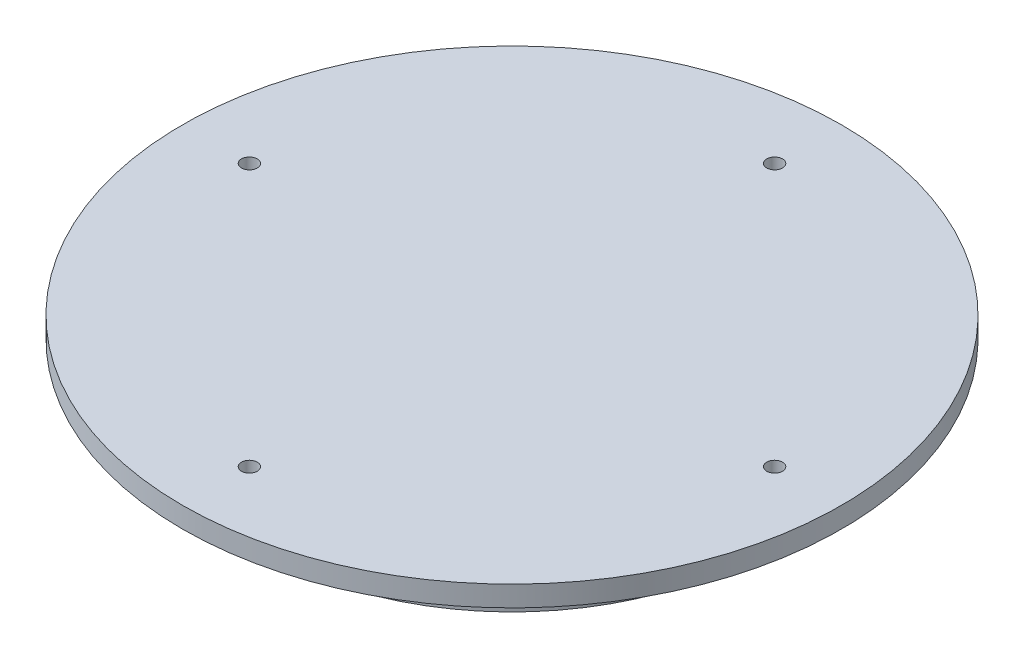
ISO-10303-21;
HEADER;
FILE_DESCRIPTION(('STEP AP214'),'2;1');
FILE_NAME('part.step','',(''),(''),'','','');
FILE_SCHEMA(('AUTOMOTIVE_DESIGN { 1 0 10303 214 1 1 1 1 }'));
ENDSEC;
DATA;
#1=APPLICATION_CONTEXT('core data for automotive mechanical design processes');
#2=APPLICATION_PROTOCOL_DEFINITION('international standard','automotive_design',2000,#1);
#3=PRODUCT_CONTEXT('',#1,'mechanical');
#4=PRODUCT('Part','Part','',(#3));
#5=PRODUCT_RELATED_PRODUCT_CATEGORY('part','',(#4));
#6=PRODUCT_DEFINITION_FORMATION('','',#4);
#7=PRODUCT_DEFINITION_CONTEXT('part definition',#1,'design');
#8=PRODUCT_DEFINITION('design','',#6,#7);
#9=PRODUCT_DEFINITION_SHAPE('','',#8);
#10=(LENGTH_UNIT() NAMED_UNIT(*) SI_UNIT(.MILLI.,.METRE.));
#11=(NAMED_UNIT(*) PLANE_ANGLE_UNIT() SI_UNIT($,.RADIAN.));
#12=(NAMED_UNIT(*) SI_UNIT($,.STERADIAN.) SOLID_ANGLE_UNIT());
#13=UNCERTAINTY_MEASURE_WITH_UNIT(LENGTH_MEASURE(1.E-05),#10,'distance_accuracy_value','');
#14=(GEOMETRIC_REPRESENTATION_CONTEXT(3) GLOBAL_UNCERTAINTY_ASSIGNED_CONTEXT((#13)) GLOBAL_UNIT_ASSIGNED_CONTEXT((#10,
#11,#12)) REPRESENTATION_CONTEXT('',''));
#15=CARTESIAN_POINT('',(0.,0.,0.));
#16=DIRECTION('',(0.,0.,1.));
#17=DIRECTION('',(1.,0.,0.));
#18=AXIS2_PLACEMENT_3D('',#15,#16,#17);
#19=CARTESIAN_POINT('',(0.,0.,0.));
#20=DIRECTION('',(0.,1.,0.));
#21=DIRECTION('',(0.,0.,1.));
#22=AXIS2_PLACEMENT_3D('',#19,#20,#21);
#23=PLANE('',#22);
#24=CARTESIAN_POINT('',(0.,0.,-40.48125));
#25=DIRECTION('',(0.,1.,0.));
#26=DIRECTION('',(0.,0.,1.));
#27=AXIS2_PLACEMENT_3D('',#24,#25,#26);
#28=CIRCLE('',#27,1.2192);
#29=CARTESIAN_POINT('',(0.,0.,-39.26205));
#30=VERTEX_POINT('',#29);
#31=EDGE_CURVE('E37',#30,#30,#28,.T.);
#32=ORIENTED_EDGE('',*,*,#31,.T.);
#33=EDGE_LOOP('',(#32));
#34=FACE_BOUND('',#33,.T.);
#35=CARTESIAN_POINT('',(40.48125,0.,0.));
#36=DIRECTION('',(0.,1.,0.));
#37=DIRECTION('',(0.,0.,1.));
#38=AXIS2_PLACEMENT_3D('',#35,#36,#37);
#39=CIRCLE('',#38,1.2192);
#40=CARTESIAN_POINT('',(40.48125,0.,1.21919999999999));
#41=VERTEX_POINT('',#40);
#42=EDGE_CURVE('E68',#41,#41,#39,.T.);
#43=ORIENTED_EDGE('',*,*,#42,.T.);
#44=EDGE_LOOP('',(#43));
#45=FACE_BOUND('',#44,.T.);
#46=CARTESIAN_POINT('',(-40.48125,0.,0.));
#47=DIRECTION('',(0.,1.,0.));
#48=DIRECTION('',(0.,0.,1.));
#49=AXIS2_PLACEMENT_3D('',#46,#47,#48);
#50=CIRCLE('',#49,1.2192);
#51=CARTESIAN_POINT('',(-40.48125,0.,1.2192));
#52=VERTEX_POINT('',#51);
#53=EDGE_CURVE('E58',#52,#52,#50,.T.);
#54=ORIENTED_EDGE('',*,*,#53,.T.);
#55=EDGE_LOOP('',(#54));
#56=FACE_BOUND('',#55,.T.);
#57=CARTESIAN_POINT('',(0.,0.,40.48125));
#58=DIRECTION('',(0.,1.,0.));
#59=DIRECTION('',(0.,0.,1.));
#60=AXIS2_PLACEMENT_3D('',#57,#58,#59);
#61=CIRCLE('',#60,1.2192);
#62=CARTESIAN_POINT('',(0.,0.,41.70045));
#63=VERTEX_POINT('',#62);
#64=EDGE_CURVE('E49',#63,#63,#61,.T.);
#65=ORIENTED_EDGE('',*,*,#64,.T.);
#66=EDGE_LOOP('',(#65));
#67=FACE_BOUND('',#66,.T.);
#68=CARTESIAN_POINT('',(0.,0.,0.));
#69=DIRECTION('',(0.,1.,0.));
#70=DIRECTION('',(0.,0.,1.));
#71=AXIS2_PLACEMENT_3D('',#68,#69,#70);
#72=CIRCLE('',#71,50.8);
#73=CARTESIAN_POINT('',(0.,0.,50.8));
#74=VERTEX_POINT('',#73);
#75=EDGE_CURVE('E46',#74,#74,#72,.T.);
#76=ORIENTED_EDGE('',*,*,#75,.F.);
#77=EDGE_LOOP('',(#76));
#78=FACE_BOUND('',#77,.T.);
#79=CARTESIAN_POINT('',(0.,0.,0.));
#80=DIRECTION('',(0.,1.,0.));
#81=DIRECTION('',(0.,0.,1.));
#82=AXIS2_PLACEMENT_3D('',#79,#80,#81);
#83=CIRCLE('',#82,38.1);
#84=CARTESIAN_POINT('',(0.,0.,38.1));
#85=VERTEX_POINT('',#84);
#86=EDGE_CURVE('E10',#85,#85,#83,.F.);
#87=ORIENTED_EDGE('',*,*,#86,.F.);
#88=EDGE_LOOP('',(#87));
#89=FACE_BOUND('',#88,.T.);
#90=ADVANCED_FACE('F33',(#34,#45,#56,#67,#78,#89),#23,.F.);
#91=CARTESIAN_POINT('',(0.,3.175,0.));
#92=DIRECTION('',(0.,-1.,0.));
#93=DIRECTION('',(0.,0.,-1.));
#94=AXIS2_PLACEMENT_3D('',#91,#92,#93);
#95=CYLINDRICAL_SURFACE('',#94,50.8);
#96=CARTESIAN_POINT('',(0.,3.175,0.));
#97=DIRECTION('',(0.,1.,0.));
#98=DIRECTION('',(0.,0.,1.));
#99=AXIS2_PLACEMENT_3D('',#96,#97,#98);
#100=CIRCLE('',#99,50.8);
#101=CARTESIAN_POINT('',(0.,3.175,50.8));
#102=VERTEX_POINT('',#101);
#103=EDGE_CURVE('E41',#102,#102,#100,.T.);
#104=ORIENTED_EDGE('',*,*,#103,.F.);
#105=EDGE_LOOP('',(#104));
#106=FACE_BOUND('',#105,.T.);
#107=ORIENTED_EDGE('',*,*,#75,.T.);
#108=EDGE_LOOP('',(#107));
#109=FACE_BOUND('',#108,.T.);
#110=ADVANCED_FACE('F35',(#106,#109),#95,.T.);
#111=CARTESIAN_POINT('',(0.,3.175,0.));
#112=DIRECTION('',(0.,1.,0.));
#113=DIRECTION('',(0.,0.,1.));
#114=AXIS2_PLACEMENT_3D('',#111,#112,#113);
#115=PLANE('',#114);
#116=CARTESIAN_POINT('',(0.,3.175,-40.48125));
#117=DIRECTION('',(0.,1.,0.));
#118=DIRECTION('',(0.,0.,1.));
#119=AXIS2_PLACEMENT_3D('',#116,#117,#118);
#120=CIRCLE('',#119,1.2192);
#121=CARTESIAN_POINT('',(0.,3.175,-39.26205));
#122=VERTEX_POINT('',#121);
#123=EDGE_CURVE('E74',#122,#122,#120,.T.);
#124=ORIENTED_EDGE('',*,*,#123,.F.);
#125=EDGE_LOOP('',(#124));
#126=FACE_BOUND('',#125,.T.);
#127=CARTESIAN_POINT('',(40.48125,3.175,0.));
#128=DIRECTION('',(0.,1.,0.));
#129=DIRECTION('',(0.,0.,1.));
#130=AXIS2_PLACEMENT_3D('',#127,#128,#129);
#131=CIRCLE('',#130,1.2192);
#132=CARTESIAN_POINT('',(40.48125,3.175,1.21919999999999));
#133=VERTEX_POINT('',#132);
#134=EDGE_CURVE('E71',#133,#133,#131,.T.);
#135=ORIENTED_EDGE('',*,*,#134,.F.);
#136=EDGE_LOOP('',(#135));
#137=FACE_BOUND('',#136,.T.);
#138=CARTESIAN_POINT('',(-40.48125,3.175,0.));
#139=DIRECTION('',(0.,1.,0.));
#140=DIRECTION('',(0.,0.,1.));
#141=AXIS2_PLACEMENT_3D('',#138,#139,#140);
#142=CIRCLE('',#141,1.2192);
#143=CARTESIAN_POINT('',(-40.48125,3.175,1.2192));
#144=VERTEX_POINT('',#143);
#145=EDGE_CURVE('E63',#144,#144,#142,.T.);
#146=ORIENTED_EDGE('',*,*,#145,.F.);
#147=EDGE_LOOP('',(#146));
#148=FACE_BOUND('',#147,.T.);
#149=CARTESIAN_POINT('',(0.,3.175,40.48125));
#150=DIRECTION('',(0.,1.,0.));
#151=DIRECTION('',(0.,0.,1.));
#152=AXIS2_PLACEMENT_3D('',#149,#150,#151);
#153=CIRCLE('',#152,1.2192);
#154=CARTESIAN_POINT('',(0.,3.175,41.70045));
#155=VERTEX_POINT('',#154);
#156=EDGE_CURVE('E52',#155,#155,#153,.T.);
#157=ORIENTED_EDGE('',*,*,#156,.F.);
#158=EDGE_LOOP('',(#157));
#159=FACE_BOUND('',#158,.T.);
#160=ORIENTED_EDGE('',*,*,#103,.T.);
#161=EDGE_LOOP('',(#160));
#162=FACE_BOUND('',#161,.T.);
#163=ADVANCED_FACE('F97',(#126,#137,#148,#159,#162),#115,.T.);
#164=CARTESIAN_POINT('',(0.,-9.525,0.));
#165=DIRECTION('',(0.,1.,0.));
#166=DIRECTION('',(0.,0.,1.));
#167=AXIS2_PLACEMENT_3D('',#164,#165,#166);
#168=CYLINDRICAL_SURFACE('',#167,38.1);
#169=CARTESIAN_POINT('',(0.,-9.525,0.));
#170=DIRECTION('',(0.,-1.,0.));
#171=DIRECTION('',(0.,0.,-1.));
#172=AXIS2_PLACEMENT_3D('',#169,#170,#171);
#173=CIRCLE('',#172,38.1);
#174=CARTESIAN_POINT('',(0.,-9.525,-38.1));
#175=VERTEX_POINT('',#174);
#176=EDGE_CURVE('E51',#175,#175,#173,.T.);
#177=ORIENTED_EDGE('',*,*,#176,.F.);
#178=EDGE_LOOP('',(#177));
#179=FACE_BOUND('',#178,.T.);
#180=ORIENTED_EDGE('',*,*,#86,.T.);
#181=EDGE_LOOP('',(#180));
#182=FACE_BOUND('',#181,.T.);
#183=ADVANCED_FACE('F102',(#179,#182),#168,.T.);
#184=CARTESIAN_POINT('',(0.,-9.525,0.));
#185=DIRECTION('',(0.,-1.,0.));
#186=DIRECTION('',(0.,0.,-1.));
#187=AXIS2_PLACEMENT_3D('',#184,#185,#186);
#188=PLANE('',#187);
#189=ORIENTED_EDGE('',*,*,#176,.T.);
#190=EDGE_LOOP('',(#189));
#191=FACE_BOUND('',#190,.T.);
#192=ADVANCED_FACE('F106',(#191),#188,.T.);
#193=CARTESIAN_POINT('',(0.,3.175,40.48125));
#194=DIRECTION('',(0.,1.,0.));
#195=DIRECTION('',(0.,0.,1.));
#196=AXIS2_PLACEMENT_3D('',#193,#194,#195);
#197=CYLINDRICAL_SURFACE('',#196,1.2192);
#198=ORIENTED_EDGE('',*,*,#156,.T.);
#199=EDGE_LOOP('',(#198));
#200=FACE_BOUND('',#199,.T.);
#201=ORIENTED_EDGE('',*,*,#64,.F.);
#202=EDGE_LOOP('',(#201));
#203=FACE_BOUND('',#202,.T.);
#204=ADVANCED_FACE('F110',(#200,#203),#197,.F.);
#205=CARTESIAN_POINT('',(-40.48125,3.175,0.));
#206=DIRECTION('',(0.,1.,0.));
#207=DIRECTION('',(0.,0.,1.));
#208=AXIS2_PLACEMENT_3D('',#205,#206,#207);
#209=CYLINDRICAL_SURFACE('',#208,1.2192);
#210=ORIENTED_EDGE('',*,*,#145,.T.);
#211=EDGE_LOOP('',(#210));
#212=FACE_BOUND('',#211,.T.);
#213=ORIENTED_EDGE('',*,*,#53,.F.);
#214=EDGE_LOOP('',(#213));
#215=FACE_BOUND('',#214,.T.);
#216=ADVANCED_FACE('F90',(#212,#215),#209,.F.);
#217=CARTESIAN_POINT('',(40.48125,3.175,0.));
#218=DIRECTION('',(0.,1.,0.));
#219=DIRECTION('',(0.,0.,1.));
#220=AXIS2_PLACEMENT_3D('',#217,#218,#219);
#221=CYLINDRICAL_SURFACE('',#220,1.2192);
#222=ORIENTED_EDGE('',*,*,#134,.T.);
#223=EDGE_LOOP('',(#222));
#224=FACE_BOUND('',#223,.T.);
#225=ORIENTED_EDGE('',*,*,#42,.F.);
#226=EDGE_LOOP('',(#225));
#227=FACE_BOUND('',#226,.T.);
#228=ADVANCED_FACE('F85',(#224,#227),#221,.F.);
#229=CARTESIAN_POINT('',(0.,3.175,-40.48125));
#230=DIRECTION('',(0.,1.,0.));
#231=DIRECTION('',(0.,0.,1.));
#232=AXIS2_PLACEMENT_3D('',#229,#230,#231);
#233=CYLINDRICAL_SURFACE('',#232,1.2192);
#234=ORIENTED_EDGE('',*,*,#123,.T.);
#235=EDGE_LOOP('',(#234));
#236=FACE_BOUND('',#235,.T.);
#237=ORIENTED_EDGE('',*,*,#31,.F.);
#238=EDGE_LOOP('',(#237));
#239=FACE_BOUND('',#238,.T.);
#240=ADVANCED_FACE('F83',(#236,#239),#233,.F.);
#241=CLOSED_SHELL('',(#90,#110,#163,#183,#192,#204,#216,#228,#240));
#242=MANIFOLD_SOLID_BREP('B2',#241);
#243=ADVANCED_BREP_SHAPE_REPRESENTATION('',(#18,#242),#14);
#244=SHAPE_DEFINITION_REPRESENTATION(#9,#243);
ENDSEC;
END-ISO-10303-21;
